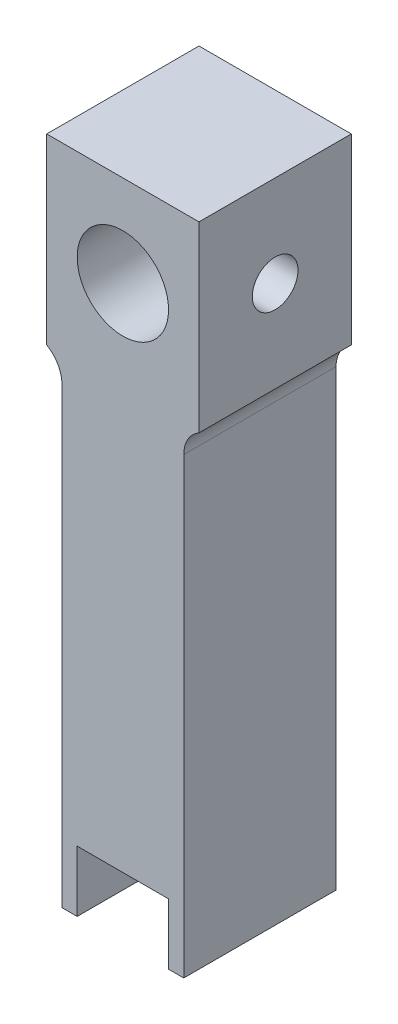
ISO-10303-21;
HEADER;
FILE_DESCRIPTION(('STEP AP214'),'2;1');
FILE_NAME('part.step','',(''),(''),'','','');
FILE_SCHEMA(('AUTOMOTIVE_DESIGN { 1 0 10303 214 1 1 1 1 }'));
ENDSEC;
DATA;
#1=APPLICATION_CONTEXT('core data for automotive mechanical design processes');
#2=APPLICATION_PROTOCOL_DEFINITION('international standard','automotive_design',2000,#1);
#3=PRODUCT_CONTEXT('',#1,'mechanical');
#4=PRODUCT('Part','Part','',(#3));
#5=PRODUCT_RELATED_PRODUCT_CATEGORY('part','',(#4));
#6=PRODUCT_DEFINITION_FORMATION('','',#4);
#7=PRODUCT_DEFINITION_CONTEXT('part definition',#1,'design');
#8=PRODUCT_DEFINITION('design','',#6,#7);
#9=PRODUCT_DEFINITION_SHAPE('','',#8);
#10=(LENGTH_UNIT() NAMED_UNIT(*) SI_UNIT(.MILLI.,.METRE.));
#11=(NAMED_UNIT(*) PLANE_ANGLE_UNIT() SI_UNIT($,.RADIAN.));
#12=(NAMED_UNIT(*) SI_UNIT($,.STERADIAN.) SOLID_ANGLE_UNIT());
#13=UNCERTAINTY_MEASURE_WITH_UNIT(LENGTH_MEASURE(1.E-05),#10,'distance_accuracy_value','');
#14=(GEOMETRIC_REPRESENTATION_CONTEXT(3) GLOBAL_UNCERTAINTY_ASSIGNED_CONTEXT((#13)) GLOBAL_UNIT_ASSIGNED_CONTEXT((#10,
#11,#12)) REPRESENTATION_CONTEXT('',''));
#15=CARTESIAN_POINT('',(0.,0.,0.));
#16=DIRECTION('',(0.,0.,1.));
#17=DIRECTION('',(1.,0.,0.));
#18=AXIS2_PLACEMENT_3D('',#15,#16,#17);
#19=CARTESIAN_POINT('',(5.,0.,10.));
#20=DIRECTION('',(1.,0.,0.));
#21=DIRECTION('',(0.,1.,0.));
#22=AXIS2_PLACEMENT_3D('',#19,#20,#21);
#23=PLANE('',#22);
#24=CARTESIAN_POINT('',(5.,0.,5.));
#25=DIRECTION('',(-1.,0.,0.));
#26=DIRECTION('',(0.,-1.,0.));
#27=AXIS2_PLACEMENT_3D('',#24,#25,#26);
#28=CIRCLE('',#27,1.5);
#29=CARTESIAN_POINT('',(5.,-1.5,5.));
#30=VERTEX_POINT('',#29);
#31=EDGE_CURVE('E241',#30,#30,#28,.T.);
#32=ORIENTED_EDGE('',*,*,#31,.T.);
#33=EDGE_LOOP('',(#32));
#34=FACE_BOUND('',#33,.T.);
#35=DIRECTION('',(0.,-1.,0.));
#36=VECTOR('',#35,1.);
#37=CARTESIAN_POINT('',(5.,0.,0.));
#38=LINE('',#37,#36);
#39=CARTESIAN_POINT('',(5.,6.,0.));
#40=VERTEX_POINT('',#39);
#41=CARTESIAN_POINT('',(5.,-6.,0.));
#42=VERTEX_POINT('',#41);
#43=EDGE_CURVE('E142',#40,#42,#38,.T.);
#44=ORIENTED_EDGE('',*,*,#43,.F.);
#45=DIRECTION('',(0.,0.,-1.));
#46=VECTOR('',#45,1.);
#47=CARTESIAN_POINT('',(5.,6.,10.));
#48=LINE('',#47,#46);
#49=CARTESIAN_POINT('',(5.,6.,10.));
#50=VERTEX_POINT('',#49);
#51=EDGE_CURVE('E136',#50,#40,#48,.T.);
#52=ORIENTED_EDGE('',*,*,#51,.F.);
#53=DIRECTION('',(0.,-1.,0.));
#54=VECTOR('',#53,1.);
#55=CARTESIAN_POINT('',(5.,0.,10.));
#56=LINE('',#55,#54);
#57=CARTESIAN_POINT('',(5.,-6.,10.));
#58=VERTEX_POINT('',#57);
#59=EDGE_CURVE('E139',#50,#58,#56,.T.);
#60=ORIENTED_EDGE('',*,*,#59,.T.);
#61=DIRECTION('',(0.,0.,-1.));
#62=VECTOR('',#61,1.);
#63=CARTESIAN_POINT('',(5.,-6.,10.));
#64=LINE('',#63,#62);
#65=EDGE_CURVE('E183',#58,#42,#64,.T.);
#66=ORIENTED_EDGE('',*,*,#65,.T.);
#67=EDGE_LOOP('',(#44,#52,#60,#66));
#68=FACE_BOUND('',#67,.T.);
#69=ADVANCED_FACE('F49',(#34,#68),#23,.T.);
#70=CARTESIAN_POINT('',(0.,6.,10.));
#71=DIRECTION('',(0.,1.,0.));
#72=DIRECTION('',(0.,0.,1.));
#73=AXIS2_PLACEMENT_3D('',#70,#71,#72);
#74=PLANE('',#73);
#75=DIRECTION('',(1.,0.,0.));
#76=VECTOR('',#75,1.);
#77=CARTESIAN_POINT('',(0.,6.,0.));
#78=LINE('',#77,#76);
#79=CARTESIAN_POINT('',(-5.,6.,0.));
#80=VERTEX_POINT('',#79);
#81=EDGE_CURVE('E189',#80,#40,#78,.T.);
#82=ORIENTED_EDGE('',*,*,#81,.F.);
#83=DIRECTION('',(0.,0.,-1.));
#84=VECTOR('',#83,1.);
#85=CARTESIAN_POINT('',(-5.,6.,10.));
#86=LINE('',#85,#84);
#87=CARTESIAN_POINT('',(-5.,6.,10.));
#88=VERTEX_POINT('',#87);
#89=EDGE_CURVE('E148',#88,#80,#86,.T.);
#90=ORIENTED_EDGE('',*,*,#89,.F.);
#91=DIRECTION('',(1.,0.,0.));
#92=VECTOR('',#91,1.);
#93=CARTESIAN_POINT('',(0.,6.,10.));
#94=LINE('',#93,#92);
#95=EDGE_CURVE('E152',#88,#50,#94,.T.);
#96=ORIENTED_EDGE('',*,*,#95,.T.);
#97=ORIENTED_EDGE('',*,*,#51,.T.);
#98=EDGE_LOOP('',(#82,#90,#96,#97));
#99=FACE_BOUND('',#98,.T.);
#100=ADVANCED_FACE('F158',(#99),#74,.T.);
#101=CARTESIAN_POINT('',(-5.,0.,10.));
#102=DIRECTION('',(1.,0.,0.));
#103=DIRECTION('',(0.,1.,0.));
#104=AXIS2_PLACEMENT_3D('',#101,#102,#103);
#105=PLANE('',#104);
#106=CARTESIAN_POINT('',(-5.,0.,5.));
#107=DIRECTION('',(-1.,0.,0.));
#108=DIRECTION('',(0.,-1.,0.));
#109=AXIS2_PLACEMENT_3D('',#106,#107,#108);
#110=CIRCLE('',#109,1.5);
#111=CARTESIAN_POINT('',(-5.,-1.5,5.));
#112=VERTEX_POINT('',#111);
#113=EDGE_CURVE('E303',#112,#112,#110,.T.);
#114=ORIENTED_EDGE('',*,*,#113,.F.);
#115=EDGE_LOOP('',(#114));
#116=FACE_BOUND('',#115,.T.);
#117=DIRECTION('',(0.,-1.,0.));
#118=VECTOR('',#117,1.);
#119=CARTESIAN_POINT('',(-5.,0.,0.));
#120=LINE('',#119,#118);
#121=CARTESIAN_POINT('',(-5.,-6.,0.));
#122=VERTEX_POINT('',#121);
#123=EDGE_CURVE('E191',#80,#122,#120,.T.);
#124=ORIENTED_EDGE('',*,*,#123,.T.);
#125=DIRECTION('',(0.,0.,-1.));
#126=VECTOR('',#125,1.);
#127=CARTESIAN_POINT('',(-5.,-6.,10.));
#128=LINE('',#127,#126);
#129=CARTESIAN_POINT('',(-5.,-6.,10.));
#130=VERTEX_POINT('',#129);
#131=EDGE_CURVE('E230',#130,#122,#128,.T.);
#132=ORIENTED_EDGE('',*,*,#131,.F.);
#133=DIRECTION('',(0.,-1.,0.));
#134=VECTOR('',#133,1.);
#135=CARTESIAN_POINT('',(-5.,0.,10.));
#136=LINE('',#135,#134);
#137=EDGE_CURVE('E160',#88,#130,#136,.T.);
#138=ORIENTED_EDGE('',*,*,#137,.F.);
#139=ORIENTED_EDGE('',*,*,#89,.T.);
#140=EDGE_LOOP('',(#124,#132,#138,#139));
#141=FACE_BOUND('',#140,.T.);
#142=ADVANCED_FACE('F290',(#116,#141),#105,.F.);
#143=CARTESIAN_POINT('',(-4.,0.,10.));
#144=DIRECTION('',(1.,0.,0.));
#145=DIRECTION('',(0.,1.,0.));
#146=AXIS2_PLACEMENT_3D('',#143,#144,#145);
#147=PLANE('',#146);
#148=DIRECTION('',(0.,-1.,0.));
#149=VECTOR('',#148,1.);
#150=CARTESIAN_POINT('',(-4.,0.,10.));
#151=LINE('',#150,#149);
#152=CARTESIAN_POINT('',(-4.,-7.73205080756888,10.));
#153=VERTEX_POINT('',#152);
#154=CARTESIAN_POINT('',(-3.99999999999999,-37.5,10.));
#155=VERTEX_POINT('',#154);
#156=EDGE_CURVE('E162',#153,#155,#151,.T.);
#157=ORIENTED_EDGE('',*,*,#156,.F.);
#158=DIRECTION('',(0.,0.,-1.));
#159=VECTOR('',#158,1.);
#160=CARTESIAN_POINT('',(-4.,-7.73205080756888,10.));
#161=LINE('',#160,#159);
#162=CARTESIAN_POINT('',(-4.,-7.73205080756888,0.));
#163=VERTEX_POINT('',#162);
#164=EDGE_CURVE('E321',#153,#163,#161,.T.);
#165=ORIENTED_EDGE('',*,*,#164,.T.);
#166=DIRECTION('',(0.,-1.,0.));
#167=VECTOR('',#166,1.);
#168=CARTESIAN_POINT('',(-4.,0.,0.));
#169=LINE('',#168,#167);
#170=CARTESIAN_POINT('',(-3.99999999999999,-37.5,0.));
#171=VERTEX_POINT('',#170);
#172=EDGE_CURVE('E194',#163,#171,#169,.T.);
#173=ORIENTED_EDGE('',*,*,#172,.T.);
#174=DIRECTION('',(0.,0.,-1.));
#175=VECTOR('',#174,1.);
#176=CARTESIAN_POINT('',(-3.99999999999999,-37.5,10.));
#177=LINE('',#176,#175);
#178=EDGE_CURVE('E227',#155,#171,#177,.T.);
#179=ORIENTED_EDGE('',*,*,#178,.F.);
#180=EDGE_LOOP('',(#157,#165,#173,#179));
#181=FACE_BOUND('',#180,.T.);
#182=ADVANCED_FACE('F286',(#181),#147,.F.);
#183=CARTESIAN_POINT('',(0.,-37.5,10.));
#184=DIRECTION('',(0.,1.,0.));
#185=DIRECTION('',(0.,0.,1.));
#186=AXIS2_PLACEMENT_3D('',#183,#184,#185);
#187=PLANE('',#186);
#188=DIRECTION('',(1.,0.,0.));
#189=VECTOR('',#188,1.);
#190=CARTESIAN_POINT('',(0.,-37.5,0.));
#191=LINE('',#190,#189);
#192=CARTESIAN_POINT('',(-3.,-37.5,0.));
#193=VERTEX_POINT('',#192);
#194=EDGE_CURVE('E196',#171,#193,#191,.T.);
#195=ORIENTED_EDGE('',*,*,#194,.T.);
#196=DIRECTION('',(0.,0.,-1.));
#197=VECTOR('',#196,1.);
#198=CARTESIAN_POINT('',(-3.,-37.5,10.));
#199=LINE('',#198,#197);
#200=CARTESIAN_POINT('',(-3.,-37.5,10.));
#201=VERTEX_POINT('',#200);
#202=EDGE_CURVE('E224',#201,#193,#199,.T.);
#203=ORIENTED_EDGE('',*,*,#202,.F.);
#204=DIRECTION('',(1.,0.,0.));
#205=VECTOR('',#204,1.);
#206=CARTESIAN_POINT('',(0.,-37.5,10.));
#207=LINE('',#206,#205);
#208=EDGE_CURVE('E167',#155,#201,#207,.T.);
#209=ORIENTED_EDGE('',*,*,#208,.F.);
#210=ORIENTED_EDGE('',*,*,#178,.T.);
#211=EDGE_LOOP('',(#195,#203,#209,#210));
#212=FACE_BOUND('',#211,.T.);
#213=ADVANCED_FACE('F282',(#212),#187,.F.);
#214=CARTESIAN_POINT('',(-3.,0.,10.));
#215=DIRECTION('',(-1.,0.,0.));
#216=DIRECTION('',(0.,0.,1.));
#217=AXIS2_PLACEMENT_3D('',#214,#215,#216);
#218=PLANE('',#217);
#219=DIRECTION('',(0.,1.,0.));
#220=VECTOR('',#219,1.);
#221=CARTESIAN_POINT('',(-3.,0.,0.));
#222=LINE('',#221,#220);
#223=CARTESIAN_POINT('',(-3.,-33.5,0.));
#224=VERTEX_POINT('',#223);
#225=EDGE_CURVE('E199',#193,#224,#222,.T.);
#226=ORIENTED_EDGE('',*,*,#225,.T.);
#227=DIRECTION('',(0.,0.,-1.));
#228=VECTOR('',#227,1.);
#229=CARTESIAN_POINT('',(-3.,-33.5,10.));
#230=LINE('',#229,#228);
#231=CARTESIAN_POINT('',(-3.,-33.5,10.));
#232=VERTEX_POINT('',#231);
#233=EDGE_CURVE('E221',#232,#224,#230,.T.);
#234=ORIENTED_EDGE('',*,*,#233,.F.);
#235=DIRECTION('',(0.,1.,0.));
#236=VECTOR('',#235,1.);
#237=CARTESIAN_POINT('',(-3.,0.,10.));
#238=LINE('',#237,#236);
#239=EDGE_CURVE('E170',#201,#232,#238,.T.);
#240=ORIENTED_EDGE('',*,*,#239,.F.);
#241=ORIENTED_EDGE('',*,*,#202,.T.);
#242=EDGE_LOOP('',(#226,#234,#240,#241));
#243=FACE_BOUND('',#242,.T.);
#244=ADVANCED_FACE('F278',(#243),#218,.F.);
#245=CARTESIAN_POINT('',(0.,-33.5,10.));
#246=DIRECTION('',(0.,1.,0.));
#247=DIRECTION('',(0.,0.,1.));
#248=AXIS2_PLACEMENT_3D('',#245,#246,#247);
#249=PLANE('',#248);
#250=DIRECTION('',(1.,0.,0.));
#251=VECTOR('',#250,1.);
#252=CARTESIAN_POINT('',(0.,-33.5,0.));
#253=LINE('',#252,#251);
#254=CARTESIAN_POINT('',(3.,-33.5,0.));
#255=VERTEX_POINT('',#254);
#256=EDGE_CURVE('E202',#224,#255,#253,.T.);
#257=ORIENTED_EDGE('',*,*,#256,.T.);
#258=DIRECTION('',(0.,0.,-1.));
#259=VECTOR('',#258,1.);
#260=CARTESIAN_POINT('',(3.,-33.5,10.));
#261=LINE('',#260,#259);
#262=CARTESIAN_POINT('',(3.,-33.5,10.));
#263=VERTEX_POINT('',#262);
#264=EDGE_CURVE('E219',#263,#255,#261,.T.);
#265=ORIENTED_EDGE('',*,*,#264,.F.);
#266=DIRECTION('',(1.,0.,0.));
#267=VECTOR('',#266,1.);
#268=CARTESIAN_POINT('',(0.,-33.5,10.));
#269=LINE('',#268,#267);
#270=EDGE_CURVE('E173',#232,#263,#269,.T.);
#271=ORIENTED_EDGE('',*,*,#270,.F.);
#272=ORIENTED_EDGE('',*,*,#233,.T.);
#273=EDGE_LOOP('',(#257,#265,#271,#272));
#274=FACE_BOUND('',#273,.T.);
#275=ADVANCED_FACE('F274',(#274),#249,.F.);
#276=CARTESIAN_POINT('',(3.,0.,10.));
#277=DIRECTION('',(-1.,0.,0.));
#278=DIRECTION('',(0.,0.,1.));
#279=AXIS2_PLACEMENT_3D('',#276,#277,#278);
#280=PLANE('',#279);
#281=DIRECTION('',(0.,1.,0.));
#282=VECTOR('',#281,1.);
#283=CARTESIAN_POINT('',(3.,0.,0.));
#284=LINE('',#283,#282);
#285=CARTESIAN_POINT('',(3.,-37.5,0.));
#286=VERTEX_POINT('',#285);
#287=EDGE_CURVE('E205',#286,#255,#284,.T.);
#288=ORIENTED_EDGE('',*,*,#287,.F.);
#289=DIRECTION('',(0.,0.,-1.));
#290=VECTOR('',#289,1.);
#291=CARTESIAN_POINT('',(3.,-37.5,10.));
#292=LINE('',#291,#290);
#293=CARTESIAN_POINT('',(3.,-37.5,10.));
#294=VERTEX_POINT('',#293);
#295=EDGE_CURVE('E217',#294,#286,#292,.T.);
#296=ORIENTED_EDGE('',*,*,#295,.F.);
#297=DIRECTION('',(0.,1.,0.));
#298=VECTOR('',#297,1.);
#299=CARTESIAN_POINT('',(3.,0.,10.));
#300=LINE('',#299,#298);
#301=EDGE_CURVE('E175',#294,#263,#300,.T.);
#302=ORIENTED_EDGE('',*,*,#301,.T.);
#303=ORIENTED_EDGE('',*,*,#264,.T.);
#304=EDGE_LOOP('',(#288,#296,#302,#303));
#305=FACE_BOUND('',#304,.T.);
#306=ADVANCED_FACE('F270',(#305),#280,.T.);
#307=CARTESIAN_POINT('',(0.,-37.5,10.));
#308=DIRECTION('',(0.,1.,0.));
#309=DIRECTION('',(0.,0.,1.));
#310=AXIS2_PLACEMENT_3D('',#307,#308,#309);
#311=PLANE('',#310);
#312=DIRECTION('',(1.,0.,0.));
#313=VECTOR('',#312,1.);
#314=CARTESIAN_POINT('',(0.,-37.5,0.));
#315=LINE('',#314,#313);
#316=CARTESIAN_POINT('',(4.,-37.5,0.));
#317=VERTEX_POINT('',#316);
#318=EDGE_CURVE('E208',#286,#317,#315,.T.);
#319=ORIENTED_EDGE('',*,*,#318,.T.);
#320=DIRECTION('',(0.,0.,-1.));
#321=VECTOR('',#320,1.);
#322=CARTESIAN_POINT('',(4.,-37.5,10.));
#323=LINE('',#322,#321);
#324=CARTESIAN_POINT('',(4.,-37.5,10.));
#325=VERTEX_POINT('',#324);
#326=EDGE_CURVE('E214',#325,#317,#323,.T.);
#327=ORIENTED_EDGE('',*,*,#326,.F.);
#328=DIRECTION('',(1.,0.,0.));
#329=VECTOR('',#328,1.);
#330=CARTESIAN_POINT('',(0.,-37.5,10.));
#331=LINE('',#330,#329);
#332=EDGE_CURVE('E178',#294,#325,#331,.T.);
#333=ORIENTED_EDGE('',*,*,#332,.F.);
#334=ORIENTED_EDGE('',*,*,#295,.T.);
#335=EDGE_LOOP('',(#319,#327,#333,#334));
#336=FACE_BOUND('',#335,.T.);
#337=ADVANCED_FACE('F266',(#336),#311,.F.);
#338=CARTESIAN_POINT('',(4.,0.,10.));
#339=DIRECTION('',(1.,0.,0.));
#340=DIRECTION('',(0.,1.,0.));
#341=AXIS2_PLACEMENT_3D('',#338,#339,#340);
#342=PLANE('',#341);
#343=DIRECTION('',(0.,-1.,0.));
#344=VECTOR('',#343,1.);
#345=CARTESIAN_POINT('',(4.,0.,0.));
#346=LINE('',#345,#344);
#347=CARTESIAN_POINT('',(4.,-7.73205080756888,0.));
#348=VERTEX_POINT('',#347);
#349=EDGE_CURVE('E211',#348,#317,#346,.T.);
#350=ORIENTED_EDGE('',*,*,#349,.F.);
#351=DIRECTION('',(0.,0.,1.));
#352=VECTOR('',#351,1.);
#353=CARTESIAN_POINT('',(4.,-7.73205080756888,10.));
#354=LINE('',#353,#352);
#355=CARTESIAN_POINT('',(4.,-7.73205080756888,10.));
#356=VERTEX_POINT('',#355);
#357=EDGE_CURVE('E147',#348,#356,#354,.T.);
#358=ORIENTED_EDGE('',*,*,#357,.T.);
#359=DIRECTION('',(0.,-1.,0.));
#360=VECTOR('',#359,1.);
#361=CARTESIAN_POINT('',(4.,0.,10.));
#362=LINE('',#361,#360);
#363=EDGE_CURVE('E181',#356,#325,#362,.T.);
#364=ORIENTED_EDGE('',*,*,#363,.T.);
#365=ORIENTED_EDGE('',*,*,#326,.T.);
#366=EDGE_LOOP('',(#350,#358,#364,#365));
#367=FACE_BOUND('',#366,.T.);
#368=ADVANCED_FACE('F263',(#367),#342,.T.);
#369=CARTESIAN_POINT('',(0.,0.,10.));
#370=DIRECTION('',(0.,0.,-1.));
#371=DIRECTION('',(-1.,0.,0.));
#372=AXIS2_PLACEMENT_3D('',#369,#370,#371);
#373=CYLINDRICAL_SURFACE('',#372,3.);
#374=CARTESIAN_POINT('',(-3.,0.,6.5));
#375=CARTESIAN_POINT('',(-2.99999570107562,-0.0788579444268502,6.49999504652421));
#376=CARTESIAN_POINT('',(-2.99685736529635,-0.157809899546344,6.49374489031842));
#377=CARTESIAN_POINT('',(-2.98461234055736,-0.313380352903344,6.46902067948769));
#378=CARTESIAN_POINT('',(-2.97549431743379,-0.389994130070445,6.45052341050328));
#379=CARTESIAN_POINT('',(-2.95224419105063,-0.538400317320673,6.40220928707506));
#380=CARTESIAN_POINT('',(-2.93813158766306,-0.610210204408719,6.37243642362805));
#381=CARTESIAN_POINT('',(-2.90618664773642,-0.747708925209898,6.30264406795252));
#382=CARTESIAN_POINT('',(-2.88835460450288,-0.813398240985089,6.2626253836267));
#383=CARTESIAN_POINT('',(-2.84934387387093,-0.941261726642864,6.17072412577207));
#384=CARTESIAN_POINT('',(-2.82802798691306,-1.00298281668316,6.11827028114054));
#385=CARTESIAN_POINT('',(-2.78489955370115,-1.11716916730047,6.00421778112944));
#386=CARTESIAN_POINT('',(-2.76308664313552,-1.16962737466015,5.94261222234134));
#387=CARTESIAN_POINT('',(-2.71948426796021,-1.26787800067542,5.80627497571493));
#388=CARTESIAN_POINT('',(-2.69782780455198,-1.31283800332746,5.73089585248113));
#389=CARTESIAN_POINT('',(-2.65928968158481,-1.38925234033604,5.57244899602068));
#390=CARTESIAN_POINT('',(-2.64240461410484,-1.4207163224495,5.48938680691588));
#391=CARTESIAN_POINT('',(-2.61686800556713,-1.46719866328288,5.32300234186712));
#392=CARTESIAN_POINT('',(-2.6077840737557,-1.48308878562066,5.23999332189891));
#393=CARTESIAN_POINT('',(-2.59772834922792,-1.50064048996327,5.07203174333078));
#394=CARTESIAN_POINT('',(-2.59674854014932,-1.50231613255961,4.98708118869327));
#395=CARTESIAN_POINT('',(-2.60266395385873,-1.49203093075844,4.82857096352695));
#396=CARTESIAN_POINT('',(-2.6086314549302,-1.48167683930523,4.75486395316543));
#397=CARTESIAN_POINT('',(-2.62614343100775,-1.4504097735854,4.61041713594044));
#398=CARTESIAN_POINT('',(-2.63768968247664,-1.42949343584648,4.53967828204203));
#399=CARTESIAN_POINT('',(-2.66531214619112,-1.37731467057901,4.40115630115151));
#400=CARTESIAN_POINT('',(-2.68148760995998,-1.34582260067399,4.33348040182132));
#401=CARTESIAN_POINT('',(-2.71655106422106,-1.273562531502,4.20404856111499));
#402=CARTESIAN_POINT('',(-2.73544027170286,-1.2327903657187,4.14229529659987));
#403=CARTESIAN_POINT('',(-2.77669736854929,-1.13709908236918,4.01821812088516));
#404=CARTESIAN_POINT('',(-2.79920265355119,-1.08104168755392,3.95681468963576));
#405=CARTESIAN_POINT('',(-2.84321434950611,-0.959333368112061,3.84389687211365));
#406=CARTESIAN_POINT('',(-2.86472027938201,-0.893677884861429,3.79238721194918));
#407=CARTESIAN_POINT('',(-2.90552980924446,-0.750774758747774,3.69847150845541));
#408=CARTESIAN_POINT('',(-2.92468476243011,-0.673130387399115,3.65659929133139));
#409=CARTESIAN_POINT('',(-2.95736821681863,-0.510699323233197,3.58685445643549));
#410=CARTESIAN_POINT('',(-2.9709011841533,-0.425918364397916,3.55897072247725));
#411=CARTESIAN_POINT('',(-2.98986500612153,-0.259149737491055,3.52028689442499));
#412=CARTESIAN_POINT('',(-2.99587407451965,-0.177512295822491,3.50826314637983));
#413=CARTESIAN_POINT('',(-3.00109520188655,-0.0131693999240289,3.49780290329827));
#414=CARTESIAN_POINT('',(-3.00031048081978,0.0695355298048616,3.4993599715408));
#415=CARTESIAN_POINT('',(-2.99236788380152,0.226849457978979,3.51531003262812));
#416=CARTESIAN_POINT('',(-2.98570868532253,0.301589112074894,3.52869879909499));
#417=CARTESIAN_POINT('',(-2.9673325697226,0.44761033845291,3.56635710784268));
#418=CARTESIAN_POINT('',(-2.95561509501618,0.518891528536629,3.59062784968024));
#419=CARTESIAN_POINT('',(-2.92776377120382,0.658332912674358,3.64999769964955));
#420=CARTESIAN_POINT('',(-2.91151322654446,0.726345595508704,3.68538657517443));
#421=CARTESIAN_POINT('',(-2.87615961476126,0.855692042548906,3.76566130346985));
#422=CARTESIAN_POINT('',(-2.85705533350408,0.917022944664886,3.81055120189309));
#423=CARTESIAN_POINT('',(-2.81562332004297,1.03765153393382,3.91364063799607));
#424=CARTESIAN_POINT('',(-2.79316327265249,1.09615811672854,3.97271430266772));
#425=CARTESIAN_POINT('',(-2.7489358741323,1.20278448167828,4.09988772691659));
#426=CARTESIAN_POINT('',(-2.72716901100071,1.25089707856781,4.16799367827188));
#427=CARTESIAN_POINT('',(-2.68576788309734,1.33756187171853,4.31546548125946));
#428=CARTESIAN_POINT('',(-2.66628794383591,1.37553824370037,4.39521689914172));
#429=CARTESIAN_POINT('',(-2.63361108441202,1.43712423890205,4.56126510136245));
#430=CARTESIAN_POINT('',(-2.62040607332625,1.46075237380052,4.64755328970033));
#431=CARTESIAN_POINT('',(-2.60342251538703,1.49079253120031,4.81536533432705));
#432=CARTESIAN_POINT('',(-2.59886075197597,1.49863949460818,4.89655138015286));
#433=CARTESIAN_POINT('',(-2.59748031962405,1.5010337315643,5.05917060074679));
#434=CARTESIAN_POINT('',(-2.60065829439585,1.49558676993486,5.14060365310679));
#435=CARTESIAN_POINT('',(-2.61356793076615,1.47288918838996,5.29322525230016));
#436=CARTESIAN_POINT('',(-2.62264641723988,1.45681247151455,5.36465070521711));
#437=CARTESIAN_POINT('',(-2.64556524281479,1.41476303733662,5.50371217913655));
#438=CARTESIAN_POINT('',(-2.65940711354503,1.38878713673988,5.57134697313805));
#439=CARTESIAN_POINT('',(-2.69142795546804,1.32572361795085,5.7059372764798));
#440=CARTESIAN_POINT('',(-2.70983583593881,1.28800670672355,5.77254185274354));
#441=CARTESIAN_POINT('',(-2.74852997452291,1.20322645745609,5.89891180427189));
#442=CARTESIAN_POINT('',(-2.76881720693416,1.15615825686234,5.95867359578167));
#443=CARTESIAN_POINT('',(-2.81193484737138,1.04730498999206,6.07721297353201));
#444=CARTESIAN_POINT('',(-2.83477474959942,0.984426634495892,6.13498865352544));
#445=CARTESIAN_POINT('',(-2.87816628389896,0.849232209349796,6.2393944751529));
#446=CARTESIAN_POINT('',(-2.89871667939293,0.776911084957797,6.28601860920486));
#447=CARTESIAN_POINT('',(-2.93547014349806,0.62389739517442,6.3668545440681));
#448=CARTESIAN_POINT('',(-2.95164144740899,0.543149255665097,6.4009762538547));
#449=CARTESIAN_POINT('',(-2.9775201194848,0.37611315170713,6.45471225163611));
#450=CARTESIAN_POINT('',(-2.98724585044602,0.289841699383651,6.47436777020857));
#451=CARTESIAN_POINT('',(-2.99543192870217,0.168902919736344,6.49084611662861));
#452=CARTESIAN_POINT('',(-2.99714048010376,0.135242819162349,6.49427396129951));
#453=CARTESIAN_POINT('',(-2.99942545465223,0.0677275977076384,6.49885199827113));
#454=CARTESIAN_POINT('',(-3.00000184655071,0.0338724714699432,6.50000212770531));
#455=CARTESIAN_POINT('',(-3.,0.,6.5));
#456=B_SPLINE_CURVE_WITH_KNOTS('',3,(#374,#375,#376,#377,#378,#379,#380,#381,#382,#383,#384,
#385,#386,#387,#388,#389,#390,#391,#392,#393,#394,#395,#396,#397,#398,#399,#400,#401,#402,#403,
#404,#405,#406,#407,#408,#409,#410,#411,#412,#413,#414,#415,#416,#417,#418,#419,#420,#421,#422,
#423,#424,#425,#426,#427,#428,#429,#430,#431,#432,#433,#434,#435,#436,#437,#438,#439,#440,#441,
#442,#443,#444,#445,#446,#447,#448,#449,#450,#451,#452,#453,#454,#455),.UNSPECIFIED.,.T.,.F.,(4,
2,2,2,2,2,2,2,2,2,2,2,2,2,2,2,2,2,2,2,2,2,2,2,2,2,2,2,2,2,2,2,2,2,2,2,2,2,2,2,4),(0.,
0.236436386130439,0.473322224563796,0.709293233238447,0.945245640872351,1.19547263807713,
1.44588935648105,1.71572589646129,1.98536921847421,2.23887018210344,2.49212035993531,
2.71508568613981,2.93812205888518,3.16635360252731,3.39468781890332,3.65197412000818,
3.90938301898029,4.17874533321661,4.44789325368419,4.69474935707018,4.94148846767214,
5.16910359759183,5.39674382446397,5.63089284041848,5.86514176122509,6.12239415966628,
6.37982382923147,6.64972023242588,6.91926767918176,7.16293961254569,7.40650589797017,
7.62686895373283,7.84730293182526,8.0825468517043,8.31791341715446,8.58187864135757,
8.84598575071868,9.11196020495289,9.37717362931723,9.47872920200875,9.58028757766598),.UNSPECIFIED.);
#457=CARTESIAN_POINT('',(-3.,0.,6.5));
#458=VERTEX_POINT('',#457);
#459=EDGE_CURVE('E187',#458,#458,#456,.T.);
#460=ORIENTED_EDGE('',*,*,#459,.F.);
#461=EDGE_LOOP('',(#460));
#462=FACE_BOUND('',#461,.T.);
#463=CARTESIAN_POINT('',(2.59807621135332,-1.5,5.));
#464=CARTESIAN_POINT('',(2.59808302092689,-1.4999945446118,5.07816171229288));
#465=CARTESIAN_POINT('',(2.60165701781635,-1.49384995609982,5.15642211728757));
#466=CARTESIAN_POINT('',(2.61543549678079,-1.46958481484708,5.31054089701573));
#467=CARTESIAN_POINT('',(2.62565391083339,-1.45143909683127,5.38639387256511));
#468=CARTESIAN_POINT('',(2.65124019908098,-1.40414992304972,5.53317749651591));
#469=CARTESIAN_POINT('',(2.66658065209878,-1.3750649287406,5.60413197871038));
#470=CARTESIAN_POINT('',(2.70063997225287,-1.30690128806456,5.74013630299508));
#471=CARTESIAN_POINT('',(2.71935902214097,-1.26782210105366,5.80518582539369));
#472=CARTESIAN_POINT('',(2.75995303586162,-1.17699981079632,5.93345859283626));
#473=CARTESIAN_POINT('',(2.7819609545693,-1.12447805421566,5.99608870351032));
#474=CARTESIAN_POINT('',(2.82557974178559,-1.0098807114217,6.11211258261006));
#475=CARTESIAN_POINT('',(2.84719040746875,-0.947800388673439,6.16550174387528));
#476=CARTESIAN_POINT('',(2.88932215429424,-0.810734345121818,6.26505072672149));
#477=CARTESIAN_POINT('',(2.90967159627259,-0.735160783518861,6.3104806517893));
#478=CARTESIAN_POINT('',(2.94526134149294,-0.576235539899255,6.38771127986864));
#479=CARTESIAN_POINT('',(2.96050486775612,-0.492888807207231,6.41952058420576));
#480=CARTESIAN_POINT('',(2.98320691866356,-0.327067415888964,6.46625699195165));
#481=CARTESIAN_POINT('',(2.99114220331338,-0.244952685733225,6.4822242895333));
#482=CARTESIAN_POINT('',(3.00011375769101,-0.0788559430467713,6.50024917801256));
#483=CARTESIAN_POINT('',(3.00115420176885,0.00512490876560854,6.50231518519356));
#484=CARTESIAN_POINT('',(2.99644472874675,0.164748786635626,6.49287998904448));
#485=CARTESIAN_POINT('',(2.99127743838241,0.240481798765188,6.48254297671817));
#486=CARTESIAN_POINT('',(2.97561367889621,0.388970657877484,6.45067873414301));
#487=CARTESIAN_POINT('',(2.96511681099591,0.461726281640889,6.42915066653566));
#488=CARTESIAN_POINT('',(2.93957374931482,0.603464087354331,6.37537615086528));
#489=CARTESIAN_POINT('',(2.92446662293799,0.672380135272768,6.3429855302419));
#490=CARTESIAN_POINT('',(2.89106468980031,0.803965202269994,6.26860487569776));
#491=CARTESIAN_POINT('',(2.87276874236226,0.866631973257969,6.22661140504647));
#492=CARTESIAN_POINT('',(2.83266591598844,0.990260491347292,6.12965697270048));
#493=CARTESIAN_POINT('',(2.81069063997263,1.05050111254404,6.07384545751098));
#494=CARTESIAN_POINT('',(2.76681510880218,1.16115655544667,5.95311541260473));
#495=CARTESIAN_POINT('',(2.74491492398443,1.21156381736135,5.88818994158891));
#496=CARTESIAN_POINT('',(2.70216234138727,1.30425800196332,5.74602771136387));
#497=CARTESIAN_POINT('',(2.68146479986061,1.34582597246708,5.66827096541868));
#498=CARTESIAN_POINT('',(2.64563175417864,1.41497866950185,5.5055934929615));
#499=CARTESIAN_POINT('',(2.63049045069101,1.44257798731633,5.42068035047366));
#500=CARTESIAN_POINT('',(2.60916953725552,1.48077031653756,5.25317823307581));
#501=CARTESIAN_POINT('',(2.60237483772745,1.49253768317996,5.17093832143467));
#502=CARTESIAN_POINT('',(2.59676879042414,1.50227541991714,5.00539798772519));
#503=CARTESIAN_POINT('',(2.59795180333967,1.50025553597254,4.92209835632032));
#504=CARTESIAN_POINT('',(2.60751504810877,1.48355406501595,4.76651912213191));
#505=CARTESIAN_POINT('',(2.61509381259981,1.4702817250687,4.69403082333811));
#506=CARTESIAN_POINT('',(2.63541032327012,1.43354442694866,4.55244832059356));
#507=CARTESIAN_POINT('',(2.64814974007551,1.41007616793542,4.48335522388009));
#508=CARTESIAN_POINT('',(2.67804333119485,1.35247138290733,4.34688300364596));
#509=CARTESIAN_POINT('',(2.69537464864595,1.31789109553908,4.27973147471967));
#510=CARTESIAN_POINT('',(2.73234179245875,1.23943059602371,4.15179609269151));
#511=CARTESIAN_POINT('',(2.75197880032721,1.19554560649832,4.09101553473007));
#512=CARTESIAN_POINT('',(2.79431997684504,1.09325575079828,3.96953184871468));
#513=CARTESIAN_POINT('',(2.81709874731434,1.03371790847245,3.90980427392351));
#514=CARTESIAN_POINT('',(2.86101352466839,0.905106743097433,3.80088164300961));
#515=CARTESIAN_POINT('',(2.88214897511564,0.83603021198302,3.75169014465419));
#516=CARTESIAN_POINT('',(2.92112042536435,0.687803043838135,3.66413941107485));
#517=CARTESIAN_POINT('',(2.93885462508044,0.608434646361169,3.62610032268363));
#518=CARTESIAN_POINT('',(2.96825032438952,0.443283546961623,3.56429314421391));
#519=CARTESIAN_POINT('',(2.9799171551456,0.357506552088263,3.54051252295054));
#520=CARTESIAN_POINT('',(2.99501262272824,0.190469523495625,3.50994715373801));
#521=CARTESIAN_POINT('',(2.99909891862287,0.109517165775685,3.50180318618583));
#522=CARTESIAN_POINT('',(3.00063195562697,-0.0526889789268059,3.4987351018184));
#523=CARTESIAN_POINT('',(2.99808102100335,-0.133942650442631,3.50380635721465));
#524=CARTESIAN_POINT('',(2.98700953256884,-0.288806988475721,3.52612461019344));
#525=CARTESIAN_POINT('',(2.97889342001985,-0.362568476716896,3.54254727388651));
#526=CARTESIAN_POINT('',(2.95788140495135,-0.506168928275427,3.58599049895446));
#527=CARTESIAN_POINT('',(2.94498481699194,-0.576007327433264,3.61301258014018));
#528=CARTESIAN_POINT('',(2.9148889612218,-0.713135109367327,3.67809057824896));
#529=CARTESIAN_POINT('',(2.89752925798199,-0.780187714050069,3.71656898481176));
#530=CARTESIAN_POINT('',(2.86032199712739,-0.907161962721037,3.80293689628858));
#531=CARTESIAN_POINT('',(2.84047329837541,-0.96708031112236,3.85083072367351));
#532=CARTESIAN_POINT('',(2.79792915339941,-1.08437100623534,3.96019570853406));
#533=CARTESIAN_POINT('',(2.77514698517547,-1.14089652680891,4.02254373121579));
#534=CARTESIAN_POINT('',(2.73094614244279,-1.24299493109201,4.15617608169466));
#535=CARTESIAN_POINT('',(2.70952868642798,-1.28855812501509,4.22746823130153));
#536=CARTESIAN_POINT('',(2.66999407957374,-1.36864661967848,4.37995496987143));
#537=CARTESIAN_POINT('',(2.65200261384405,-1.40277759894141,4.46139129669311));
#538=CARTESIAN_POINT('',(2.62299234492527,-1.45631806425962,4.62999860650967));
#539=CARTESIAN_POINT('',(2.61195024221553,-1.47577678676302,4.71714933336903));
#540=CARTESIAN_POINT('',(2.60293908902686,-1.49155051179662,4.83770803347799));
#541=CARTESIAN_POINT('',(2.60112193507728,-1.49471415744578,4.87005184159683));
#542=CARTESIAN_POINT('',(2.59868903831625,-1.49894010763494,4.93492472102337));
#543=CARTESIAN_POINT('',(2.59807337587664,-1.50000227159981,4.96745380457881));
#544=CARTESIAN_POINT('',(2.59807621135332,-1.5,5.));
#545=B_SPLINE_CURVE_WITH_KNOTS('',3,(#463,#464,#465,#466,#467,#468,#469,#470,#471,#472,#473,
#474,#475,#476,#477,#478,#479,#480,#481,#482,#483,#484,#485,#486,#487,#488,#489,#490,#491,#492,
#493,#494,#495,#496,#497,#498,#499,#500,#501,#502,#503,#504,#505,#506,#507,#508,#509,#510,#511,
#512,#513,#514,#515,#516,#517,#518,#519,#520,#521,#522,#523,#524,#525,#526,#527,#528,#529,#530,
#531,#532,#533,#534,#535,#536,#537,#538,#539,#540,#541,#542,#543,#544),.UNSPECIFIED.,.T.,.F.,(4,
2,2,2,2,2,2,2,2,2,2,2,2,2,2,2,2,2,2,2,2,2,2,2,2,2,2,2,2,2,2,2,2,2,2,2,2,2,2,2,4),(0.,
0.234348183892072,0.469189339237207,0.702792893878329,0.936409088167724,1.18929346874735,
1.44230356626556,1.71236838358145,1.98226240445837,2.23295227451903,2.4834903552906,
2.71224146226807,2.94100968776183,3.1729430209672,3.40495949025408,3.65890787185336,
3.91305072368878,4.18333262594172,4.45333161317557,4.70193436281318,4.95036139782559,
5.17161275136038,5.39293578654095,5.62450944609131,5.85620229330071,6.1171011537092,
6.37808797467303,6.64596272119449,6.91360169713157,7.1566840558423,7.39968130190957,
7.62666637307239,7.85368400268019,8.09041126079208,8.32724745151078,8.58765362775101,
8.84828914267731,9.11716123557907,9.3851269950414,9.48270202777964,9.58028358741811),.UNSPECIFIED.);
#546=CARTESIAN_POINT('',(2.59807621135332,-1.5,5.));
#547=VERTEX_POINT('',#546);
#548=EDGE_CURVE('E233',#547,#547,#545,.T.);
#549=ORIENTED_EDGE('',*,*,#548,.F.);
#550=EDGE_LOOP('',(#549));
#551=FACE_BOUND('',#550,.T.);
#552=CARTESIAN_POINT('',(0.,0.,10.));
#553=DIRECTION('',(0.,0.,1.));
#554=DIRECTION('',(1.,0.,0.));
#555=AXIS2_PLACEMENT_3D('',#552,#553,#554);
#556=CIRCLE('',#555,3.);
#557=CARTESIAN_POINT('',(3.,0.,10.));
#558=VERTEX_POINT('',#557);
#559=EDGE_CURVE('E156',#558,#558,#556,.T.);
#560=ORIENTED_EDGE('',*,*,#559,.T.);
#561=EDGE_LOOP('',(#560));
#562=FACE_BOUND('',#561,.T.);
#563=CARTESIAN_POINT('',(0.,0.,0.));
#564=DIRECTION('',(0.,0.,1.));
#565=DIRECTION('',(1.,0.,0.));
#566=AXIS2_PLACEMENT_3D('',#563,#564,#565);
#567=CIRCLE('',#566,3.);
#568=CARTESIAN_POINT('',(3.,0.,0.));
#569=VERTEX_POINT('',#568);
#570=EDGE_CURVE('E184',#569,#569,#567,.T.);
#571=ORIENTED_EDGE('',*,*,#570,.F.);
#572=EDGE_LOOP('',(#571));
#573=FACE_BOUND('',#572,.T.);
#574=ADVANCED_FACE('F246',(#462,#551,#562,#573),#373,.F.);
#575=CARTESIAN_POINT('',(0.,0.,10.));
#576=DIRECTION('',(0.,0.,1.));
#577=DIRECTION('',(1.,0.,0.));
#578=AXIS2_PLACEMENT_3D('',#575,#576,#577);
#579=PLANE('',#578);
#580=ORIENTED_EDGE('',*,*,#559,.F.);
#581=EDGE_LOOP('',(#580));
#582=FACE_BOUND('',#581,.T.);
#583=ORIENTED_EDGE('',*,*,#59,.F.);
#584=ORIENTED_EDGE('',*,*,#95,.F.);
#585=ORIENTED_EDGE('',*,*,#137,.T.);
#586=CARTESIAN_POINT('',(-6.,-7.73205080756888,10.));
#587=DIRECTION('',(0.,0.,1.));
#588=DIRECTION('',(1.,0.,0.));
#589=AXIS2_PLACEMENT_3D('',#586,#587,#588);
#590=CIRCLE('',#589,2.);
#591=EDGE_CURVE('E13',#130,#153,#590,.F.);
#592=ORIENTED_EDGE('',*,*,#591,.T.);
#593=ORIENTED_EDGE('',*,*,#156,.T.);
#594=ORIENTED_EDGE('',*,*,#208,.T.);
#595=ORIENTED_EDGE('',*,*,#239,.T.);
#596=ORIENTED_EDGE('',*,*,#270,.T.);
#597=ORIENTED_EDGE('',*,*,#301,.F.);
#598=ORIENTED_EDGE('',*,*,#332,.T.);
#599=ORIENTED_EDGE('',*,*,#363,.F.);
#600=CARTESIAN_POINT('',(6.,-7.73205080756888,10.));
#601=DIRECTION('',(0.,0.,1.));
#602=DIRECTION('',(1.,0.,0.));
#603=AXIS2_PLACEMENT_3D('',#600,#601,#602);
#604=CIRCLE('',#603,2.);
#605=EDGE_CURVE('E155',#356,#58,#604,.F.);
#606=ORIENTED_EDGE('',*,*,#605,.T.);
#607=EDGE_LOOP('',(#583,#584,#585,#592,#593,#594,#595,#596,#597,#598,#599,#606));
#608=FACE_BOUND('',#607,.T.);
#609=ADVANCED_FACE('F151',(#582,#608),#579,.T.);
#610=CARTESIAN_POINT('',(0.,0.,0.));
#611=DIRECTION('',(0.,0.,1.));
#612=DIRECTION('',(1.,0.,0.));
#613=AXIS2_PLACEMENT_3D('',#610,#611,#612);
#614=PLANE('',#613);
#615=ORIENTED_EDGE('',*,*,#570,.T.);
#616=EDGE_LOOP('',(#615));
#617=FACE_BOUND('',#616,.T.);
#618=ORIENTED_EDGE('',*,*,#43,.T.);
#619=CARTESIAN_POINT('',(6.,-7.73205080756888,0.));
#620=DIRECTION('',(0.,0.,1.));
#621=DIRECTION('',(1.,0.,0.));
#622=AXIS2_PLACEMENT_3D('',#619,#620,#621);
#623=CIRCLE('',#622,2.);
#624=EDGE_CURVE('E315',#42,#348,#623,.T.);
#625=ORIENTED_EDGE('',*,*,#624,.T.);
#626=ORIENTED_EDGE('',*,*,#349,.T.);
#627=ORIENTED_EDGE('',*,*,#318,.F.);
#628=ORIENTED_EDGE('',*,*,#287,.T.);
#629=ORIENTED_EDGE('',*,*,#256,.F.);
#630=ORIENTED_EDGE('',*,*,#225,.F.);
#631=ORIENTED_EDGE('',*,*,#194,.F.);
#632=ORIENTED_EDGE('',*,*,#172,.F.);
#633=CARTESIAN_POINT('',(-6.,-7.73205080756888,0.));
#634=DIRECTION('',(0.,0.,1.));
#635=DIRECTION('',(1.,0.,0.));
#636=AXIS2_PLACEMENT_3D('',#633,#634,#635);
#637=CIRCLE('',#636,2.);
#638=EDGE_CURVE('E57',#163,#122,#637,.T.);
#639=ORIENTED_EDGE('',*,*,#638,.T.);
#640=ORIENTED_EDGE('',*,*,#123,.F.);
#641=ORIENTED_EDGE('',*,*,#81,.T.);
#642=EDGE_LOOP('',(#618,#625,#626,#627,#628,#629,#630,#631,#632,#639,#640,#641));
#643=FACE_BOUND('',#642,.T.);
#644=ADVANCED_FACE('F254',(#617,#643),#614,.F.);
#645=CARTESIAN_POINT('',(5.,0.,5.));
#646=DIRECTION('',(-1.,0.,0.));
#647=DIRECTION('',(0.,-1.,0.));
#648=AXIS2_PLACEMENT_3D('',#645,#646,#647);
#649=CYLINDRICAL_SURFACE('',#648,1.5);
#650=ORIENTED_EDGE('',*,*,#548,.T.);
#651=EDGE_LOOP('',(#650));
#652=FACE_BOUND('',#651,.T.);
#653=ORIENTED_EDGE('',*,*,#31,.F.);
#654=EDGE_LOOP('',(#653));
#655=FACE_BOUND('',#654,.T.);
#656=ADVANCED_FACE('F249',(#652,#655),#649,.F.);
#657=ORIENTED_EDGE('',*,*,#459,.T.);
#658=EDGE_LOOP('',(#657));
#659=FACE_BOUND('',#658,.T.);
#660=ORIENTED_EDGE('',*,*,#113,.T.);
#661=EDGE_LOOP('',(#660));
#662=FACE_BOUND('',#661,.T.);
#663=ADVANCED_FACE('F253',(#659,#662),#649,.F.);
#664=CARTESIAN_POINT('',(6.,-7.73205080756888,10.));
#665=DIRECTION('',(0.,0.,-1.));
#666=DIRECTION('',(-1.,0.,0.));
#667=AXIS2_PLACEMENT_3D('',#664,#665,#666);
#668=CYLINDRICAL_SURFACE('',#667,2.);
#669=ORIENTED_EDGE('',*,*,#605,.F.);
#670=ORIENTED_EDGE('',*,*,#357,.F.);
#671=ORIENTED_EDGE('',*,*,#624,.F.);
#672=ORIENTED_EDGE('',*,*,#65,.F.);
#673=EDGE_LOOP('',(#669,#670,#671,#672));
#674=FACE_BOUND('',#673,.T.);
#675=ADVANCED_FACE('F330',(#674),#668,.F.);
#676=CARTESIAN_POINT('',(-6.,-7.73205080756888,10.));
#677=DIRECTION('',(0.,0.,-1.));
#678=DIRECTION('',(-1.,0.,0.));
#679=AXIS2_PLACEMENT_3D('',#676,#677,#678);
#680=CYLINDRICAL_SURFACE('',#679,2.);
#681=ORIENTED_EDGE('',*,*,#591,.F.);
#682=ORIENTED_EDGE('',*,*,#131,.T.);
#683=ORIENTED_EDGE('',*,*,#638,.F.);
#684=ORIENTED_EDGE('',*,*,#164,.F.);
#685=EDGE_LOOP('',(#681,#682,#683,#684));
#686=FACE_BOUND('',#685,.T.);
#687=ADVANCED_FACE('F51',(#686),#680,.F.);
#688=CLOSED_SHELL('',(#69,#100,#142,#182,#213,#244,#275,#306,#337,#368,#574,#609,#644,#656,#663,
#675,#687));
#689=MANIFOLD_SOLID_BREP('B2',#688);
#690=ADVANCED_BREP_SHAPE_REPRESENTATION('',(#18,#689),#14);
#691=SHAPE_DEFINITION_REPRESENTATION(#9,#690);
ENDSEC;
END-ISO-10303-21;
